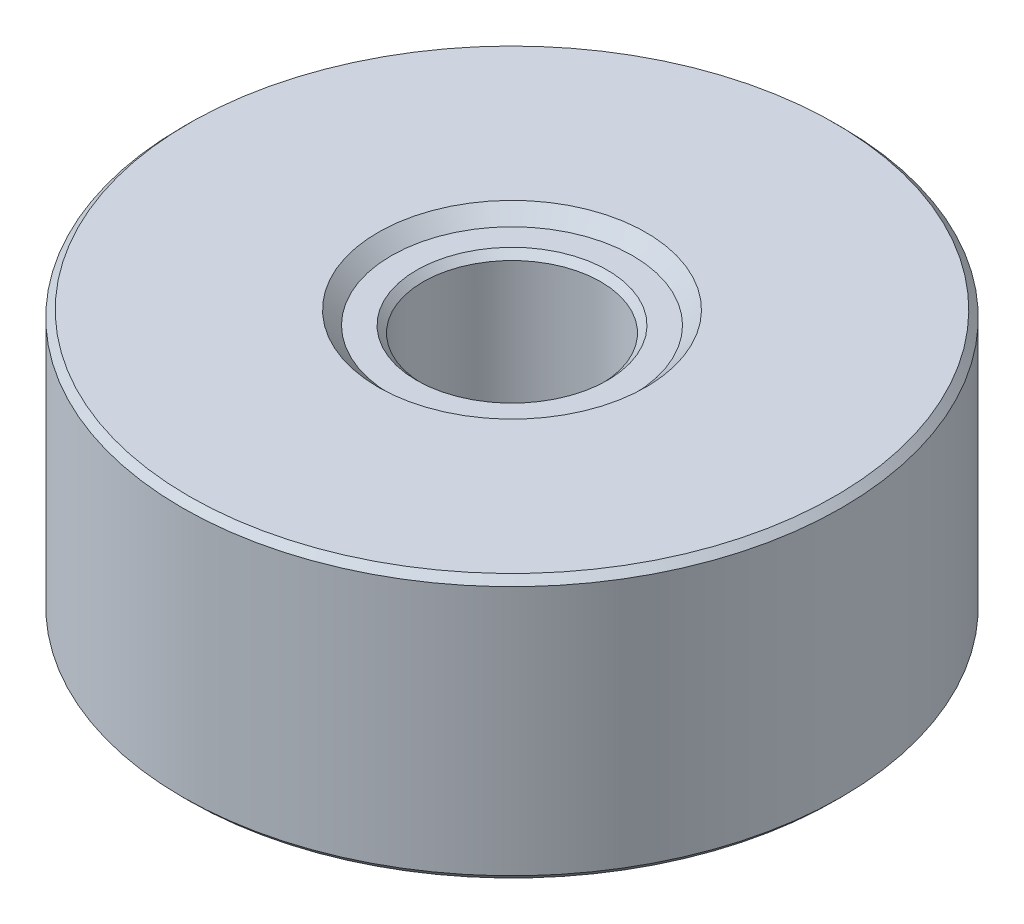
ISO-10303-21;
HEADER;
FILE_DESCRIPTION(('STEP AP214'),'2;1');
FILE_NAME('part.step','',(''),(''),'','','');
FILE_SCHEMA(('AUTOMOTIVE_DESIGN { 1 0 10303 214 1 1 1 1 }'));
ENDSEC;
DATA;
#1=APPLICATION_CONTEXT('core data for automotive mechanical design processes');
#2=APPLICATION_PROTOCOL_DEFINITION('international standard','automotive_design',2000,#1);
#3=PRODUCT_CONTEXT('',#1,'mechanical');
#4=PRODUCT('Part','Part','',(#3));
#5=PRODUCT_RELATED_PRODUCT_CATEGORY('part','',(#4));
#6=PRODUCT_DEFINITION_FORMATION('','',#4);
#7=PRODUCT_DEFINITION_CONTEXT('part definition',#1,'design');
#8=PRODUCT_DEFINITION('design','',#6,#7);
#9=PRODUCT_DEFINITION_SHAPE('','',#8);
#10=(LENGTH_UNIT() NAMED_UNIT(*) SI_UNIT(.MILLI.,.METRE.));
#11=(NAMED_UNIT(*) PLANE_ANGLE_UNIT() SI_UNIT($,.RADIAN.));
#12=(NAMED_UNIT(*) SI_UNIT($,.STERADIAN.) SOLID_ANGLE_UNIT());
#13=UNCERTAINTY_MEASURE_WITH_UNIT(LENGTH_MEASURE(1.E-05),#10,'distance_accuracy_value','');
#14=(GEOMETRIC_REPRESENTATION_CONTEXT(3) GLOBAL_UNCERTAINTY_ASSIGNED_CONTEXT((#13)) GLOBAL_UNIT_ASSIGNED_CONTEXT((#10,
#11,#12)) REPRESENTATION_CONTEXT('',''));
#15=CARTESIAN_POINT('',(0.,0.,0.));
#16=DIRECTION('',(0.,0.,1.));
#17=DIRECTION('',(1.,0.,0.));
#18=AXIS2_PLACEMENT_3D('',#15,#16,#17);
#19=CARTESIAN_POINT('',(-17.4660383331684,30.6133773572333,-8.18476017951753));
#20=DIRECTION('',(0.,-1.,0.));
#21=DIRECTION('',(0.,0.,-1.));
#22=AXIS2_PLACEMENT_3D('',#19,#20,#21);
#23=CYLINDRICAL_SURFACE('',#22,12.5);
#24=CARTESIAN_POINT('',(-17.4660383331684,20.8673773674333,-8.18476017951753));
#25=DIRECTION('',(0.,1.,0.));
#26=DIRECTION('',(0.,0.,1.));
#27=AXIS2_PLACEMENT_3D('',#24,#25,#26);
#28=CIRCLE('',#27,12.5);
#29=CARTESIAN_POINT('',(-17.4660383331684,20.8673773674333,4.31523982048248));
#30=VERTEX_POINT('',#29);
#31=EDGE_CURVE('E25',#30,#30,#28,.T.);
#32=ORIENTED_EDGE('',*,*,#31,.T.);
#33=EDGE_LOOP('',(#32));
#34=FACE_BOUND('',#33,.T.);
#35=CARTESIAN_POINT('',(-17.4660383331684,30.3593773572333,-8.18476017951753));
#36=DIRECTION('',(0.,1.,0.));
#37=DIRECTION('',(0.,0.,1.));
#38=AXIS2_PLACEMENT_3D('',#35,#36,#37);
#39=CIRCLE('',#38,12.5);
#40=CARTESIAN_POINT('',(-17.4660383331684,30.3593773572333,4.31523982048248));
#41=VERTEX_POINT('',#40);
#42=EDGE_CURVE('E29',#41,#41,#39,.F.);
#43=ORIENTED_EDGE('',*,*,#42,.T.);
#44=EDGE_LOOP('',(#43));
#45=FACE_BOUND('',#44,.T.);
#46=ADVANCED_FACE('F14',(#34,#45),#23,.T.);
#47=CARTESIAN_POINT('',(-17.4660383331684,30.6133773572333,-8.18476017951753));
#48=DIRECTION('',(0.,1.,0.));
#49=DIRECTION('',(0.,0.,1.));
#50=AXIS2_PLACEMENT_3D('',#47,#48,#49);
#51=PLANE('',#50);
#52=CARTESIAN_POINT('',(-17.4660383331684,30.6133773572333,-8.18476017951753));
#53=DIRECTION('',(0.,1.,0.));
#54=DIRECTION('',(0.,0.,1.));
#55=AXIS2_PLACEMENT_3D('',#52,#53,#54);
#56=CIRCLE('',#55,12.246);
#57=CARTESIAN_POINT('',(-17.4660383331684,30.6133773572333,4.06123982048247));
#58=VERTEX_POINT('',#57);
#59=EDGE_CURVE('E10',#58,#58,#56,.T.);
#60=ORIENTED_EDGE('',*,*,#59,.T.);
#61=EDGE_LOOP('',(#60));
#62=FACE_BOUND('',#61,.T.);
#63=CARTESIAN_POINT('',(-17.4660383331684,30.6133773572333,-8.18476017951753));
#64=DIRECTION('',(0.,1.,0.));
#65=DIRECTION('',(0.,0.,1.));
#66=AXIS2_PLACEMENT_3D('',#63,#64,#65);
#67=CIRCLE('',#66,5.08);
#68=CARTESIAN_POINT('',(-17.4660383331684,30.6133773572333,-3.10476017951752));
#69=VERTEX_POINT('',#68);
#70=EDGE_CURVE('E55',#69,#69,#67,.T.);
#71=ORIENTED_EDGE('',*,*,#70,.F.);
#72=EDGE_LOOP('',(#71));
#73=FACE_BOUND('',#72,.T.);
#74=ADVANCED_FACE('F62',(#62,#73),#51,.T.);
#75=CARTESIAN_POINT('',(-17.4660383331684,20.6133773674333,-8.18476017951753));
#76=DIRECTION('',(0.,1.,0.));
#77=DIRECTION('',(0.,0.,1.));
#78=AXIS2_PLACEMENT_3D('',#75,#76,#77);
#79=PLANE('',#78);
#80=CARTESIAN_POINT('',(-17.4660383331684,20.6133773674333,-8.18476017951753));
#81=DIRECTION('',(0.,1.,0.));
#82=DIRECTION('',(0.,0.,1.));
#83=AXIS2_PLACEMENT_3D('',#80,#81,#82);
#84=CIRCLE('',#83,12.246);
#85=CARTESIAN_POINT('',(-17.4660383331684,20.6133773674333,4.06123982048248));
#86=VERTEX_POINT('',#85);
#87=EDGE_CURVE('E21',#86,#86,#84,.F.);
#88=ORIENTED_EDGE('',*,*,#87,.T.);
#89=EDGE_LOOP('',(#88));
#90=FACE_BOUND('',#89,.T.);
#91=CARTESIAN_POINT('',(-17.4660383331684,20.6133773674333,-8.18476017951753));
#92=DIRECTION('',(0.,-1.,0.));
#93=DIRECTION('',(0.,0.,-1.));
#94=AXIS2_PLACEMENT_3D('',#91,#92,#93);
#95=CIRCLE('',#94,5.08);
#96=CARTESIAN_POINT('',(-17.4660383331684,20.6133773674333,-13.2647601795175));
#97=VERTEX_POINT('',#96);
#98=EDGE_CURVE('E52',#97,#97,#95,.T.);
#99=ORIENTED_EDGE('',*,*,#98,.F.);
#100=EDGE_LOOP('',(#99));
#101=FACE_BOUND('',#100,.T.);
#102=ADVANCED_FACE('F64',(#90,#101),#79,.F.);
#103=CARTESIAN_POINT('',(-17.4660383331684,21.1213773674333,-8.18476017951753));
#104=DIRECTION('',(0.,-1.,0.));
#105=DIRECTION('',(0.,0.,-1.));
#106=AXIS2_PLACEMENT_3D('',#103,#104,#105);
#107=PLANE('',#106);
#108=CARTESIAN_POINT('',(-17.4660383331684,21.1213773674333,-8.18476017951753));
#109=DIRECTION('',(0.,-1.,0.));
#110=DIRECTION('',(0.,0.,-1.));
#111=AXIS2_PLACEMENT_3D('',#108,#109,#110);
#112=CIRCLE('',#111,3.6195);
#113=CARTESIAN_POINT('',(-17.4660383331684,21.1213773674333,-11.8042601795175));
#114=VERTEX_POINT('',#113);
#115=EDGE_CURVE('E34',#114,#114,#112,.F.);
#116=ORIENTED_EDGE('',*,*,#115,.T.);
#117=EDGE_LOOP('',(#116));
#118=FACE_BOUND('',#117,.T.);
#119=CARTESIAN_POINT('',(-17.4660383331684,21.1213773674333,-8.18476017951753));
#120=DIRECTION('',(0.,-1.,0.));
#121=DIRECTION('',(0.,0.,-1.));
#122=AXIS2_PLACEMENT_3D('',#119,#120,#121);
#123=CIRCLE('',#122,4.572);
#124=CARTESIAN_POINT('',(-17.4660383331684,21.1213773674333,-12.7567601795175));
#125=VERTEX_POINT('',#124);
#126=EDGE_CURVE('E46',#125,#125,#123,.T.);
#127=ORIENTED_EDGE('',*,*,#126,.T.);
#128=EDGE_LOOP('',(#127));
#129=FACE_BOUND('',#128,.T.);
#130=ADVANCED_FACE('F71',(#118,#129),#107,.T.);
#131=CARTESIAN_POINT('',(-17.4660383331684,30.1053773572333,-8.18476017951753));
#132=DIRECTION('',(0.,1.,0.));
#133=DIRECTION('',(0.,0.,1.));
#134=AXIS2_PLACEMENT_3D('',#131,#132,#133);
#135=PLANE('',#134);
#136=CARTESIAN_POINT('',(-17.4660383331684,30.1053773572333,-8.18476017951753));
#137=DIRECTION('',(0.,1.,0.));
#138=DIRECTION('',(0.,0.,1.));
#139=AXIS2_PLACEMENT_3D('',#136,#137,#138);
#140=CIRCLE('',#139,3.6195);
#141=CARTESIAN_POINT('',(-17.4660383331684,30.1053773572333,-4.56526017951753));
#142=VERTEX_POINT('',#141);
#143=EDGE_CURVE('E37',#142,#142,#140,.F.);
#144=ORIENTED_EDGE('',*,*,#143,.T.);
#145=EDGE_LOOP('',(#144));
#146=FACE_BOUND('',#145,.T.);
#147=CARTESIAN_POINT('',(-17.4660383331684,30.1053773572333,-8.18476017951753));
#148=DIRECTION('',(0.,1.,0.));
#149=DIRECTION('',(0.,0.,1.));
#150=AXIS2_PLACEMENT_3D('',#147,#148,#149);
#151=CIRCLE('',#150,4.572);
#152=CARTESIAN_POINT('',(-17.4660383331684,30.1053773572333,-3.61276017951753));
#153=VERTEX_POINT('',#152);
#154=EDGE_CURVE('E49',#153,#153,#151,.T.);
#155=ORIENTED_EDGE('',*,*,#154,.T.);
#156=EDGE_LOOP('',(#155));
#157=FACE_BOUND('',#156,.T.);
#158=ADVANCED_FACE('F81',(#146,#157),#135,.T.);
#159=CARTESIAN_POINT('',(-17.4660383331684,30.1053773572333,-8.18476017951753));
#160=DIRECTION('',(0.,1.,0.));
#161=DIRECTION('',(0.,0.,1.));
#162=AXIS2_PLACEMENT_3D('',#159,#160,#161);
#163=CONICAL_SURFACE('',#162,4.572,0.785398163397447);
#164=ORIENTED_EDGE('',*,*,#70,.T.);
#165=EDGE_LOOP('',(#164));
#166=FACE_BOUND('',#165,.T.);
#167=ORIENTED_EDGE('',*,*,#154,.F.);
#168=EDGE_LOOP('',(#167));
#169=FACE_BOUND('',#168,.T.);
#170=ADVANCED_FACE('F59',(#166,#169),#163,.F.);
#171=CARTESIAN_POINT('',(-17.4660383331684,21.1213773674333,-8.18476017951753));
#172=DIRECTION('',(0.,-1.,0.));
#173=DIRECTION('',(0.,0.,-1.));
#174=AXIS2_PLACEMENT_3D('',#171,#172,#173);
#175=CONICAL_SURFACE('',#174,4.572,0.785398163397446);
#176=ORIENTED_EDGE('',*,*,#98,.T.);
#177=EDGE_LOOP('',(#176));
#178=FACE_BOUND('',#177,.T.);
#179=ORIENTED_EDGE('',*,*,#126,.F.);
#180=EDGE_LOOP('',(#179));
#181=FACE_BOUND('',#180,.T.);
#182=ADVANCED_FACE('F80',(#178,#181),#175,.F.);
#183=CARTESIAN_POINT('',(-17.4660383331684,30.6133773572333,-8.18476017951753));
#184=DIRECTION('',(0.,-1.,0.));
#185=DIRECTION('',(0.,0.,-1.));
#186=AXIS2_PLACEMENT_3D('',#183,#184,#185);
#187=CYLINDRICAL_SURFACE('',#186,3.3655);
#188=CARTESIAN_POINT('',(-17.4660383331684,29.8513773572333,-8.18476017951753));
#189=DIRECTION('',(0.,1.,0.));
#190=DIRECTION('',(0.,0.,1.));
#191=AXIS2_PLACEMENT_3D('',#188,#189,#190);
#192=CIRCLE('',#191,3.3655);
#193=CARTESIAN_POINT('',(-17.4660383331684,29.8513773572333,-4.81926017951752));
#194=VERTEX_POINT('',#193);
#195=EDGE_CURVE('E40',#194,#194,#192,.T.);
#196=ORIENTED_EDGE('',*,*,#195,.T.);
#197=EDGE_LOOP('',(#196));
#198=FACE_BOUND('',#197,.T.);
#199=CARTESIAN_POINT('',(-17.4660383331684,21.3753773674333,-8.18476017951753));
#200=DIRECTION('',(0.,-1.,0.));
#201=DIRECTION('',(0.,0.,-1.));
#202=AXIS2_PLACEMENT_3D('',#199,#200,#201);
#203=CIRCLE('',#202,3.3655);
#204=CARTESIAN_POINT('',(-17.4660383331684,21.3753773674333,-11.5502601795175));
#205=VERTEX_POINT('',#204);
#206=EDGE_CURVE('E43',#205,#205,#203,.T.);
#207=ORIENTED_EDGE('',*,*,#206,.T.);
#208=EDGE_LOOP('',(#207));
#209=FACE_BOUND('',#208,.T.);
#210=ADVANCED_FACE('F84',(#198,#209),#187,.F.);
#211=CARTESIAN_POINT('',(-17.4660383331684,29.8513773572333,-8.18476017951753));
#212=DIRECTION('',(0.,1.,0.));
#213=DIRECTION('',(0.,0.,1.));
#214=AXIS2_PLACEMENT_3D('',#211,#212,#213);
#215=CONICAL_SURFACE('',#214,3.3655,0.78539816339745);
#216=ORIENTED_EDGE('',*,*,#143,.F.);
#217=EDGE_LOOP('',(#216));
#218=FACE_BOUND('',#217,.T.);
#219=ORIENTED_EDGE('',*,*,#195,.F.);
#220=EDGE_LOOP('',(#219));
#221=FACE_BOUND('',#220,.T.);
#222=ADVANCED_FACE('F86',(#218,#221),#215,.F.);
#223=CARTESIAN_POINT('',(-17.4660383331684,21.3753773674333,-8.18476017951753));
#224=DIRECTION('',(0.,-1.,0.));
#225=DIRECTION('',(0.,0.,-1.));
#226=AXIS2_PLACEMENT_3D('',#223,#224,#225);
#227=CONICAL_SURFACE('',#226,3.3655,0.785398163397456);
#228=ORIENTED_EDGE('',*,*,#115,.F.);
#229=EDGE_LOOP('',(#228));
#230=FACE_BOUND('',#229,.T.);
#231=ORIENTED_EDGE('',*,*,#206,.F.);
#232=EDGE_LOOP('',(#231));
#233=FACE_BOUND('',#232,.T.);
#234=ADVANCED_FACE('F89',(#230,#233),#227,.F.);
#235=CARTESIAN_POINT('',(-17.4660383331684,20.8673773674333,-8.18476017951753));
#236=DIRECTION('',(0.,1.,0.));
#237=DIRECTION('',(0.,0.,1.));
#238=AXIS2_PLACEMENT_3D('',#235,#236,#237);
#239=CONICAL_SURFACE('',#238,12.5,0.785398163397452);
#240=ORIENTED_EDGE('',*,*,#87,.F.);
#241=EDGE_LOOP('',(#240));
#242=FACE_BOUND('',#241,.T.);
#243=ORIENTED_EDGE('',*,*,#31,.F.);
#244=EDGE_LOOP('',(#243));
#245=FACE_BOUND('',#244,.T.);
#246=ADVANCED_FACE('F92',(#242,#245),#239,.T.);
#247=CARTESIAN_POINT('',(-17.4660383331684,30.6133773572333,-8.18476017951753));
#248=DIRECTION('',(0.,-1.,0.));
#249=DIRECTION('',(0.,0.,-1.));
#250=AXIS2_PLACEMENT_3D('',#247,#248,#249);
#251=CONICAL_SURFACE('',#250,12.246,0.785398163397448);
#252=ORIENTED_EDGE('',*,*,#42,.F.);
#253=EDGE_LOOP('',(#252));
#254=FACE_BOUND('',#253,.T.);
#255=ORIENTED_EDGE('',*,*,#59,.F.);
#256=EDGE_LOOP('',(#255));
#257=FACE_BOUND('',#256,.T.);
#258=ADVANCED_FACE('F16',(#254,#257),#251,.T.);
#259=CLOSED_SHELL('',(#46,#74,#102,#130,#158,#170,#182,#210,#222,#234,#246,#258));
#260=MANIFOLD_SOLID_BREP('B1',#259);
#261=ADVANCED_BREP_SHAPE_REPRESENTATION('',(#18,#260),#14);
#262=SHAPE_DEFINITION_REPRESENTATION(#9,#261);
ENDSEC;
END-ISO-10303-21;
